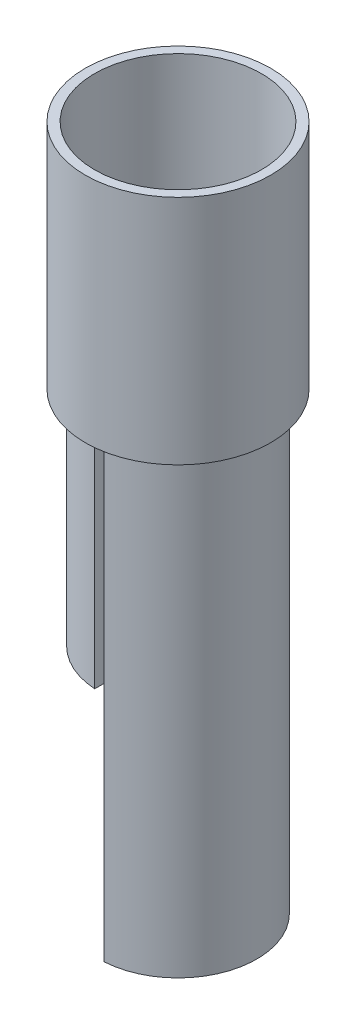
ISO-10303-21;
HEADER;
FILE_DESCRIPTION(('STEP AP214'),'2;1');
FILE_NAME('part.step','',(''),(''),'','','');
FILE_SCHEMA(('AUTOMOTIVE_DESIGN { 1 0 10303 214 1 1 1 1 }'));
ENDSEC;
DATA;
#1=APPLICATION_CONTEXT('core data for automotive mechanical design processes');
#2=APPLICATION_PROTOCOL_DEFINITION('international standard','automotive_design',2000,#1);
#3=PRODUCT_CONTEXT('',#1,'mechanical');
#4=PRODUCT('Part','Part','',(#3));
#5=PRODUCT_RELATED_PRODUCT_CATEGORY('part','',(#4));
#6=PRODUCT_DEFINITION_FORMATION('','',#4);
#7=PRODUCT_DEFINITION_CONTEXT('part definition',#1,'design');
#8=PRODUCT_DEFINITION('design','',#6,#7);
#9=PRODUCT_DEFINITION_SHAPE('','',#8);
#10=(LENGTH_UNIT() NAMED_UNIT(*) SI_UNIT(.MILLI.,.METRE.));
#11=(NAMED_UNIT(*) PLANE_ANGLE_UNIT() SI_UNIT($,.RADIAN.));
#12=(NAMED_UNIT(*) SI_UNIT($,.STERADIAN.) SOLID_ANGLE_UNIT());
#13=UNCERTAINTY_MEASURE_WITH_UNIT(LENGTH_MEASURE(1.E-05),#10,'distance_accuracy_value','');
#14=(GEOMETRIC_REPRESENTATION_CONTEXT(3) GLOBAL_UNCERTAINTY_ASSIGNED_CONTEXT((#13)) GLOBAL_UNIT_ASSIGNED_CONTEXT((#10,
#11,#12)) REPRESENTATION_CONTEXT('',''));
#15=CARTESIAN_POINT('',(0.,0.,0.));
#16=DIRECTION('',(0.,0.,1.));
#17=DIRECTION('',(1.,0.,0.));
#18=AXIS2_PLACEMENT_3D('',#15,#16,#17);
#19=CARTESIAN_POINT('',(0.,-48.,0.));
#20=DIRECTION('',(0.,1.,0.));
#21=DIRECTION('',(0.,0.,1.));
#22=AXIS2_PLACEMENT_3D('',#19,#20,#21);
#23=PLANE('',#22);
#24=DIRECTION('',(0.,0.,1.));
#25=VECTOR('',#24,1.);
#26=CARTESIAN_POINT('',(-0.999999999999993,-48.,0.));
#27=LINE('',#26,#25);
#28=CARTESIAN_POINT('',(-0.999999999999993,-48.,-16.9705627484771));
#29=VERTEX_POINT('',#28);
#30=CARTESIAN_POINT('',(-0.999999999999993,-48.,16.9705627484771));
#31=VERTEX_POINT('',#30);
#32=EDGE_CURVE('E117',#29,#31,#27,.T.);
#33=ORIENTED_EDGE('',*,*,#32,.T.);
#34=CARTESIAN_POINT('',(0.,-48.,0.));
#35=DIRECTION('',(0.,1.,0.));
#36=DIRECTION('',(0.,0.,1.));
#37=AXIS2_PLACEMENT_3D('',#34,#35,#36);
#38=CIRCLE('',#37,17.);
#39=EDGE_CURVE('E119',#29,#31,#38,.T.);
#40=ORIENTED_EDGE('',*,*,#39,.F.);
#41=EDGE_LOOP('',(#33,#40));
#42=FACE_BOUND('',#41,.T.);
#43=DIRECTION('',(0.,0.,1.));
#44=VECTOR('',#43,1.);
#45=CARTESIAN_POINT('',(-2.99999999999999,-48.,0.));
#46=LINE('',#45,#44);
#47=CARTESIAN_POINT('',(-2.99999999999999,-48.,-14.6969384566991));
#48=VERTEX_POINT('',#47);
#49=CARTESIAN_POINT('',(-2.99999999999999,-48.,14.6969384566991));
#50=VERTEX_POINT('',#49);
#51=EDGE_CURVE('E100',#48,#50,#46,.T.);
#52=ORIENTED_EDGE('',*,*,#51,.F.);
#53=CARTESIAN_POINT('',(0.,-48.,0.));
#54=DIRECTION('',(0.,1.,0.));
#55=DIRECTION('',(0.,0.,1.));
#56=AXIS2_PLACEMENT_3D('',#53,#54,#55);
#57=CIRCLE('',#56,15.);
#58=EDGE_CURVE('E115',#48,#50,#57,.T.);
#59=ORIENTED_EDGE('',*,*,#58,.T.);
#60=EDGE_LOOP('',(#52,#59));
#61=FACE_BOUND('',#60,.T.);
#62=ADVANCED_FACE('F60',(#42,#61),#23,.F.);
#63=CARTESIAN_POINT('',(0.,2.,0.));
#64=DIRECTION('',(0.,1.,0.));
#65=DIRECTION('',(0.,0.,1.));
#66=AXIS2_PLACEMENT_3D('',#63,#64,#65);
#67=PLANE('',#66);
#68=DIRECTION('',(0.,0.,1.));
#69=VECTOR('',#68,1.);
#70=CARTESIAN_POINT('',(-0.999999999999993,2.,0.));
#71=LINE('',#70,#69);
#72=CARTESIAN_POINT('',(-0.999999999999993,2.,-16.9705627484771));
#73=VERTEX_POINT('',#72);
#74=CARTESIAN_POINT('',(-0.999999999999993,2.,16.9705627484771));
#75=VERTEX_POINT('',#74);
#76=EDGE_CURVE('E102',#73,#75,#71,.T.);
#77=ORIENTED_EDGE('',*,*,#76,.F.);
#78=CARTESIAN_POINT('',(0.,2.,0.));
#79=DIRECTION('',(0.,1.,0.));
#80=DIRECTION('',(0.,0.,1.));
#81=AXIS2_PLACEMENT_3D('',#78,#79,#80);
#82=CIRCLE('',#81,17.);
#83=EDGE_CURVE('E120',#73,#75,#82,.T.);
#84=ORIENTED_EDGE('',*,*,#83,.T.);
#85=EDGE_LOOP('',(#77,#84));
#86=FACE_BOUND('',#85,.T.);
#87=CARTESIAN_POINT('',(0.,2.,0.));
#88=DIRECTION('',(0.,1.,0.));
#89=DIRECTION('',(0.,0.,1.));
#90=AXIS2_PLACEMENT_3D('',#87,#88,#89);
#91=CIRCLE('',#90,15.);
#92=CARTESIAN_POINT('',(-2.99999999999999,2.,-14.6969384566991));
#93=VERTEX_POINT('',#92);
#94=CARTESIAN_POINT('',(-2.99999999999999,2.,14.6969384566991));
#95=VERTEX_POINT('',#94);
#96=EDGE_CURVE('E106',#93,#95,#91,.T.);
#97=ORIENTED_EDGE('',*,*,#96,.F.);
#98=DIRECTION('',(0.,0.,1.));
#99=VECTOR('',#98,1.);
#100=CARTESIAN_POINT('',(-2.99999999999999,2.,0.));
#101=LINE('',#100,#99);
#102=EDGE_CURVE('E82',#93,#95,#101,.T.);
#103=ORIENTED_EDGE('',*,*,#102,.T.);
#104=EDGE_LOOP('',(#97,#103));
#105=FACE_BOUND('',#104,.T.);
#106=ADVANCED_FACE('F110',(#86,#105),#67,.T.);
#107=CARTESIAN_POINT('',(-0.999999999999993,-48.,0.));
#108=DIRECTION('',(-1.,0.,0.));
#109=DIRECTION('',(0.,0.,1.));
#110=AXIS2_PLACEMENT_3D('',#107,#108,#109);
#111=PLANE('',#110);
#112=ORIENTED_EDGE('',*,*,#76,.T.);
#113=DIRECTION('',(0.,1.,0.));
#114=VECTOR('',#113,1.);
#115=CARTESIAN_POINT('',(-0.999999999999993,-48.,16.9705627484771));
#116=LINE('',#115,#114);
#117=EDGE_CURVE('E12',#31,#75,#116,.T.);
#118=ORIENTED_EDGE('',*,*,#117,.F.);
#119=ORIENTED_EDGE('',*,*,#32,.F.);
#120=DIRECTION('',(0.,1.,0.));
#121=VECTOR('',#120,1.);
#122=CARTESIAN_POINT('',(-0.999999999999993,-48.,-16.9705627484771));
#123=LINE('',#122,#121);
#124=EDGE_CURVE('E64',#29,#73,#123,.T.);
#125=ORIENTED_EDGE('',*,*,#124,.T.);
#126=EDGE_LOOP('',(#112,#118,#119,#125));
#127=FACE_BOUND('',#126,.T.);
#128=ADVANCED_FACE('F62',(#127),#111,.F.);
#129=CARTESIAN_POINT('',(0.,-48.,0.));
#130=DIRECTION('',(0.,1.,0.));
#131=DIRECTION('',(0.,0.,1.));
#132=AXIS2_PLACEMENT_3D('',#129,#130,#131);
#133=CYLINDRICAL_SURFACE('',#132,17.);
#134=ORIENTED_EDGE('',*,*,#83,.F.);
#135=ORIENTED_EDGE('',*,*,#124,.F.);
#136=ORIENTED_EDGE('',*,*,#39,.T.);
#137=ORIENTED_EDGE('',*,*,#117,.T.);
#138=EDGE_LOOP('',(#134,#135,#136,#137));
#139=FACE_BOUND('',#138,.T.);
#140=ADVANCED_FACE('F130',(#139),#133,.T.);
#141=CARTESIAN_POINT('',(-2.99999999999999,-48.,0.));
#142=DIRECTION('',(-1.,0.,0.));
#143=DIRECTION('',(0.,0.,1.));
#144=AXIS2_PLACEMENT_3D('',#141,#142,#143);
#145=PLANE('',#144);
#146=ORIENTED_EDGE('',*,*,#102,.F.);
#147=DIRECTION('',(0.,1.,0.));
#148=VECTOR('',#147,1.);
#149=CARTESIAN_POINT('',(-2.99999999999999,-48.,-14.6969384566991));
#150=LINE('',#149,#148);
#151=EDGE_CURVE('E103',#48,#93,#150,.T.);
#152=ORIENTED_EDGE('',*,*,#151,.F.);
#153=ORIENTED_EDGE('',*,*,#51,.T.);
#154=DIRECTION('',(0.,1.,0.));
#155=VECTOR('',#154,1.);
#156=CARTESIAN_POINT('',(-2.99999999999999,-48.,14.6969384566991));
#157=LINE('',#156,#155);
#158=EDGE_CURVE('E75',#50,#95,#157,.T.);
#159=ORIENTED_EDGE('',*,*,#158,.T.);
#160=EDGE_LOOP('',(#146,#152,#153,#159));
#161=FACE_BOUND('',#160,.T.);
#162=ADVANCED_FACE('F98',(#161),#145,.T.);
#163=CARTESIAN_POINT('',(0.,-48.,0.));
#164=DIRECTION('',(0.,1.,0.));
#165=DIRECTION('',(0.,0.,1.));
#166=AXIS2_PLACEMENT_3D('',#163,#164,#165);
#167=CYLINDRICAL_SURFACE('',#166,15.);
#168=ORIENTED_EDGE('',*,*,#96,.T.);
#169=ORIENTED_EDGE('',*,*,#158,.F.);
#170=ORIENTED_EDGE('',*,*,#58,.F.);
#171=ORIENTED_EDGE('',*,*,#151,.T.);
#172=EDGE_LOOP('',(#168,#169,#170,#171));
#173=FACE_BOUND('',#172,.T.);
#174=ADVANCED_FACE('F107',(#173),#167,.F.);
#175=CLOSED_SHELL('',(#62,#106,#128,#140,#162,#174));
#176=MANIFOLD_SOLID_BREP('B2',#175);
#177=CARTESIAN_POINT('',(0.999999999999998,-48.,0.));
#178=DIRECTION('',(-1.,0.,0.));
#179=DIRECTION('',(0.,0.,1.));
#180=AXIS2_PLACEMENT_3D('',#177,#178,#179);
#181=PLANE('',#180);
#182=DIRECTION('',(0.,0.,1.));
#183=VECTOR('',#182,1.);
#184=CARTESIAN_POINT('',(0.999999999999998,2.,0.));
#185=LINE('',#184,#183);
#186=CARTESIAN_POINT('',(0.999999999999994,2.,-16.9705627484771));
#187=VERTEX_POINT('',#186);
#188=CARTESIAN_POINT('',(1.,2.,16.9705627484771));
#189=VERTEX_POINT('',#188);
#190=EDGE_CURVE('E244',#187,#189,#185,.T.);
#191=ORIENTED_EDGE('',*,*,#190,.F.);
#192=DIRECTION('',(0.,1.,0.));
#193=VECTOR('',#192,1.);
#194=CARTESIAN_POINT('',(0.999999999999994,-48.,-16.9705627484771));
#195=LINE('',#194,#193);
#196=CARTESIAN_POINT('',(0.999999999999994,-98.,-16.9705627484771));
#197=VERTEX_POINT('',#196);
#198=EDGE_CURVE('E58',#197,#187,#195,.T.);
#199=ORIENTED_EDGE('',*,*,#198,.F.);
#200=DIRECTION('',(0.,0.,-1.));
#201=VECTOR('',#200,1.);
#202=CARTESIAN_POINT('',(1.,-98.,16.9705627484771));
#203=LINE('',#202,#201);
#204=CARTESIAN_POINT('',(1.,-98.,16.9705627484771));
#205=VERTEX_POINT('',#204);
#206=EDGE_CURVE('E260',#205,#197,#203,.T.);
#207=ORIENTED_EDGE('',*,*,#206,.F.);
#208=DIRECTION('',(0.,1.,0.));
#209=VECTOR('',#208,1.);
#210=CARTESIAN_POINT('',(1.,-48.,16.9705627484771));
#211=LINE('',#210,#209);
#212=EDGE_CURVE('E198',#205,#189,#211,.T.);
#213=ORIENTED_EDGE('',*,*,#212,.T.);
#214=EDGE_LOOP('',(#191,#199,#207,#213));
#215=FACE_BOUND('',#214,.T.);
#216=ADVANCED_FACE('F195',(#215),#181,.T.);
#217=CARTESIAN_POINT('',(0.,-48.,0.));
#218=DIRECTION('',(0.,1.,0.));
#219=DIRECTION('',(0.,0.,1.));
#220=AXIS2_PLACEMENT_3D('',#217,#218,#219);
#221=CYLINDRICAL_SURFACE('',#220,17.);
#222=CARTESIAN_POINT('',(0.,2.,0.));
#223=DIRECTION('',(0.,1.,0.));
#224=DIRECTION('',(0.,0.,1.));
#225=AXIS2_PLACEMENT_3D('',#222,#223,#224);
#226=CIRCLE('',#225,17.);
#227=EDGE_CURVE('E273',#189,#187,#226,.T.);
#228=ORIENTED_EDGE('',*,*,#227,.F.);
#229=ORIENTED_EDGE('',*,*,#212,.F.);
#230=CARTESIAN_POINT('',(0.,-98.,0.));
#231=DIRECTION('',(0.,-1.,0.));
#232=DIRECTION('',(0.,0.,-1.));
#233=AXIS2_PLACEMENT_3D('',#230,#231,#232);
#234=CIRCLE('',#233,17.);
#235=EDGE_CURVE('E251',#197,#205,#234,.T.);
#236=ORIENTED_EDGE('',*,*,#235,.F.);
#237=ORIENTED_EDGE('',*,*,#198,.T.);
#238=EDGE_LOOP('',(#228,#229,#236,#237));
#239=FACE_BOUND('',#238,.T.);
#240=ADVANCED_FACE('F281',(#239),#221,.T.);
#241=CARTESIAN_POINT('',(0.,2.,0.));
#242=DIRECTION('',(0.,1.,0.));
#243=DIRECTION('',(0.,0.,1.));
#244=AXIS2_PLACEMENT_3D('',#241,#242,#243);
#245=PLANE('',#244);
#246=DIRECTION('',(0.,0.,1.));
#247=VECTOR('',#246,1.);
#248=CARTESIAN_POINT('',(3.,2.,0.));
#249=LINE('',#248,#247);
#250=CARTESIAN_POINT('',(2.99999999999999,2.,-14.6969384566991));
#251=VERTEX_POINT('',#250);
#252=CARTESIAN_POINT('',(3.,2.,14.6969384566991));
#253=VERTEX_POINT('',#252);
#254=EDGE_CURVE('E210',#251,#253,#249,.T.);
#255=ORIENTED_EDGE('',*,*,#254,.F.);
#256=CARTESIAN_POINT('',(0.,2.,0.));
#257=DIRECTION('',(0.,1.,0.));
#258=DIRECTION('',(0.,0.,1.));
#259=AXIS2_PLACEMENT_3D('',#256,#257,#258);
#260=CIRCLE('',#259,15.);
#261=EDGE_CURVE('E242',#253,#251,#260,.T.);
#262=ORIENTED_EDGE('',*,*,#261,.F.);
#263=EDGE_LOOP('',(#255,#262));
#264=FACE_BOUND('',#263,.T.);
#265=ORIENTED_EDGE('',*,*,#190,.T.);
#266=ORIENTED_EDGE('',*,*,#227,.T.);
#267=EDGE_LOOP('',(#265,#266));
#268=FACE_BOUND('',#267,.T.);
#269=ADVANCED_FACE('F280',(#264,#268),#245,.T.);
#270=CARTESIAN_POINT('',(3.,-48.,0.));
#271=DIRECTION('',(-1.,0.,0.));
#272=DIRECTION('',(0.,0.,1.));
#273=AXIS2_PLACEMENT_3D('',#270,#271,#272);
#274=PLANE('',#273);
#275=ORIENTED_EDGE('',*,*,#254,.T.);
#276=DIRECTION('',(0.,1.,0.));
#277=VECTOR('',#276,1.);
#278=CARTESIAN_POINT('',(3.,-48.,14.6969384566991));
#279=LINE('',#278,#277);
#280=CARTESIAN_POINT('',(3.,-98.,14.6969384566991));
#281=VERTEX_POINT('',#280);
#282=EDGE_CURVE('E245',#281,#253,#279,.T.);
#283=ORIENTED_EDGE('',*,*,#282,.F.);
#284=DIRECTION('',(0.,0.,-1.));
#285=VECTOR('',#284,1.);
#286=CARTESIAN_POINT('',(3.,-98.,14.6969384566991));
#287=LINE('',#286,#285);
#288=CARTESIAN_POINT('',(2.99999999999999,-98.,-14.6969384566991));
#289=VERTEX_POINT('',#288);
#290=EDGE_CURVE('E247',#281,#289,#287,.T.);
#291=ORIENTED_EDGE('',*,*,#290,.T.);
#292=DIRECTION('',(0.,1.,0.));
#293=VECTOR('',#292,1.);
#294=CARTESIAN_POINT('',(2.99999999999999,-48.,-14.6969384566991));
#295=LINE('',#294,#293);
#296=EDGE_CURVE('E235',#289,#251,#295,.T.);
#297=ORIENTED_EDGE('',*,*,#296,.T.);
#298=EDGE_LOOP('',(#275,#283,#291,#297));
#299=FACE_BOUND('',#298,.T.);
#300=ADVANCED_FACE('F248',(#299),#274,.F.);
#301=CARTESIAN_POINT('',(0.,-48.,0.));
#302=DIRECTION('',(0.,1.,0.));
#303=DIRECTION('',(0.,0.,1.));
#304=AXIS2_PLACEMENT_3D('',#301,#302,#303);
#305=CYLINDRICAL_SURFACE('',#304,15.);
#306=ORIENTED_EDGE('',*,*,#261,.T.);
#307=ORIENTED_EDGE('',*,*,#296,.F.);
#308=CARTESIAN_POINT('',(0.,-98.,0.));
#309=DIRECTION('',(0.,-1.,0.));
#310=DIRECTION('',(0.,0.,-1.));
#311=AXIS2_PLACEMENT_3D('',#308,#309,#310);
#312=CIRCLE('',#311,15.);
#313=EDGE_CURVE('E239',#289,#281,#312,.T.);
#314=ORIENTED_EDGE('',*,*,#313,.T.);
#315=ORIENTED_EDGE('',*,*,#282,.T.);
#316=EDGE_LOOP('',(#306,#307,#314,#315));
#317=FACE_BOUND('',#316,.T.);
#318=ADVANCED_FACE('F237',(#317),#305,.F.);
#319=CARTESIAN_POINT('',(0.,-98.,0.));
#320=DIRECTION('',(0.,-1.,0.));
#321=DIRECTION('',(0.,0.,-1.));
#322=AXIS2_PLACEMENT_3D('',#319,#320,#321);
#323=PLANE('',#322);
#324=ORIENTED_EDGE('',*,*,#235,.T.);
#325=ORIENTED_EDGE('',*,*,#206,.T.);
#326=EDGE_LOOP('',(#324,#325));
#327=FACE_BOUND('',#326,.T.);
#328=ORIENTED_EDGE('',*,*,#290,.F.);
#329=ORIENTED_EDGE('',*,*,#313,.F.);
#330=EDGE_LOOP('',(#328,#329));
#331=FACE_BOUND('',#330,.T.);
#332=ADVANCED_FACE('F253',(#327,#331),#323,.T.);
#333=CLOSED_SHELL('',(#216,#240,#269,#300,#318,#332));
#334=MANIFOLD_SOLID_BREP('B6',#333);
#335=CARTESIAN_POINT('',(0.,0.,0.));
#336=DIRECTION('',(0.,1.,0.));
#337=DIRECTION('',(0.,0.,1.));
#338=AXIS2_PLACEMENT_3D('',#335,#336,#337);
#339=PLANE('',#338);
#340=CARTESIAN_POINT('',(0.,0.,0.));
#341=DIRECTION('',(0.,1.,0.));
#342=DIRECTION('',(0.,0.,1.));
#343=AXIS2_PLACEMENT_3D('',#340,#341,#342);
#344=CIRCLE('',#343,17.);
#345=CARTESIAN_POINT('',(1.,0.,16.9705627484771));
#346=VERTEX_POINT('',#345);
#347=CARTESIAN_POINT('',(0.999999999999994,0.,-16.9705627484771));
#348=VERTEX_POINT('',#347);
#349=EDGE_CURVE('E391',#346,#348,#344,.T.);
#350=ORIENTED_EDGE('',*,*,#349,.T.);
#351=DIRECTION('',(0.,0.,1.));
#352=VECTOR('',#351,1.);
#353=CARTESIAN_POINT('',(0.999999999999998,0.,0.));
#354=LINE('',#353,#352);
#355=EDGE_CURVE('E389',#348,#346,#354,.T.);
#356=ORIENTED_EDGE('',*,*,#355,.T.);
#357=EDGE_LOOP('',(#350,#356));
#358=FACE_BOUND('',#357,.T.);
#359=CARTESIAN_POINT('',(0.,0.,0.));
#360=DIRECTION('',(0.,1.,0.));
#361=DIRECTION('',(0.,0.,1.));
#362=AXIS2_PLACEMENT_3D('',#359,#360,#361);
#363=CIRCLE('',#362,20.);
#364=CARTESIAN_POINT('',(0.,0.,20.));
#365=VERTEX_POINT('',#364);
#366=EDGE_CURVE('E421',#365,#365,#363,.T.);
#367=ORIENTED_EDGE('',*,*,#366,.F.);
#368=EDGE_LOOP('',(#367));
#369=FACE_BOUND('',#368,.T.);
#370=DIRECTION('',(0.,0.,1.));
#371=VECTOR('',#370,1.);
#372=CARTESIAN_POINT('',(-0.999999999999993,0.,0.));
#373=LINE('',#372,#371);
#374=CARTESIAN_POINT('',(-0.999999999999993,0.,-16.9705627484771));
#375=VERTEX_POINT('',#374);
#376=CARTESIAN_POINT('',(-0.999999999999993,0.,16.9705627484771));
#377=VERTEX_POINT('',#376);
#378=EDGE_CURVE('E193',#375,#377,#373,.T.);
#379=ORIENTED_EDGE('',*,*,#378,.F.);
#380=CARTESIAN_POINT('',(0.,0.,0.));
#381=DIRECTION('',(0.,1.,0.));
#382=DIRECTION('',(0.,0.,1.));
#383=AXIS2_PLACEMENT_3D('',#380,#381,#382);
#384=CIRCLE('',#383,17.);
#385=EDGE_CURVE('E353',#375,#377,#384,.T.);
#386=ORIENTED_EDGE('',*,*,#385,.T.);
#387=EDGE_LOOP('',(#379,#386));
#388=FACE_BOUND('',#387,.T.);
#389=ADVANCED_FACE('F345',(#358,#369,#388),#339,.F.);
#390=CARTESIAN_POINT('',(0.,2.,0.));
#391=DIRECTION('',(0.,1.,0.));
#392=DIRECTION('',(0.,0.,1.));
#393=AXIS2_PLACEMENT_3D('',#390,#391,#392);
#394=PLANE('',#393);
#395=DIRECTION('',(0.,0.,1.));
#396=VECTOR('',#395,1.);
#397=CARTESIAN_POINT('',(0.999999999999998,2.,0.));
#398=LINE('',#397,#396);
#399=CARTESIAN_POINT('',(0.999999999999994,2.,-16.9705627484771));
#400=VERTEX_POINT('',#399);
#401=CARTESIAN_POINT('',(1.,2.,16.9705627484771));
#402=VERTEX_POINT('',#401);
#403=EDGE_CURVE('E386',#400,#402,#398,.T.);
#404=ORIENTED_EDGE('',*,*,#403,.F.);
#405=CARTESIAN_POINT('',(0.,2.,0.));
#406=DIRECTION('',(0.,1.,0.));
#407=DIRECTION('',(0.,0.,1.));
#408=AXIS2_PLACEMENT_3D('',#405,#406,#407);
#409=CIRCLE('',#408,17.);
#410=EDGE_CURVE('E395',#402,#400,#409,.T.);
#411=ORIENTED_EDGE('',*,*,#410,.F.);
#412=EDGE_LOOP('',(#404,#411));
#413=FACE_BOUND('',#412,.T.);
#414=CARTESIAN_POINT('',(0.,2.,0.));
#415=DIRECTION('',(0.,1.,0.));
#416=DIRECTION('',(0.,0.,1.));
#417=AXIS2_PLACEMENT_3D('',#414,#415,#416);
#418=CIRCLE('',#417,18.);
#419=CARTESIAN_POINT('',(0.,2.,18.));
#420=VERTEX_POINT('',#419);
#421=EDGE_CURVE('E415',#420,#420,#418,.T.);
#422=ORIENTED_EDGE('',*,*,#421,.T.);
#423=EDGE_LOOP('',(#422));
#424=FACE_BOUND('',#423,.T.);
#425=CARTESIAN_POINT('',(0.,2.,0.));
#426=DIRECTION('',(0.,1.,0.));
#427=DIRECTION('',(0.,0.,1.));
#428=AXIS2_PLACEMENT_3D('',#425,#426,#427);
#429=CIRCLE('',#428,17.);
#430=CARTESIAN_POINT('',(-0.999999999999993,2.,-16.9705627484771));
#431=VERTEX_POINT('',#430);
#432=CARTESIAN_POINT('',(-0.999999999999993,2.,16.9705627484771));
#433=VERTEX_POINT('',#432);
#434=EDGE_CURVE('E409',#431,#433,#429,.T.);
#435=ORIENTED_EDGE('',*,*,#434,.F.);
#436=DIRECTION('',(0.,0.,1.));
#437=VECTOR('',#436,1.);
#438=CARTESIAN_POINT('',(-0.999999999999993,2.,0.));
#439=LINE('',#438,#437);
#440=EDGE_CURVE('E406',#431,#433,#439,.T.);
#441=ORIENTED_EDGE('',*,*,#440,.T.);
#442=EDGE_LOOP('',(#435,#441));
#443=FACE_BOUND('',#442,.T.);
#444=ADVANCED_FACE('F399',(#413,#424,#443),#394,.T.);
#445=CARTESIAN_POINT('',(0.,50.,0.));
#446=DIRECTION('',(0.,-1.,0.));
#447=DIRECTION('',(0.,0.,-1.));
#448=AXIS2_PLACEMENT_3D('',#445,#446,#447);
#449=CYLINDRICAL_SURFACE('',#448,20.);
#450=CARTESIAN_POINT('',(0.,50.,0.));
#451=DIRECTION('',(0.,1.,0.));
#452=DIRECTION('',(0.,0.,1.));
#453=AXIS2_PLACEMENT_3D('',#450,#451,#452);
#454=CIRCLE('',#453,20.);
#455=CARTESIAN_POINT('',(0.,50.,20.));
#456=VERTEX_POINT('',#455);
#457=EDGE_CURVE('E422',#456,#456,#454,.T.);
#458=ORIENTED_EDGE('',*,*,#457,.F.);
#459=EDGE_LOOP('',(#458));
#460=FACE_BOUND('',#459,.T.);
#461=ORIENTED_EDGE('',*,*,#366,.T.);
#462=EDGE_LOOP('',(#461));
#463=FACE_BOUND('',#462,.T.);
#464=ADVANCED_FACE('F347',(#460,#463),#449,.T.);
#465=CARTESIAN_POINT('',(0.,50.,0.));
#466=DIRECTION('',(0.,1.,0.));
#467=DIRECTION('',(0.,0.,1.));
#468=AXIS2_PLACEMENT_3D('',#465,#466,#467);
#469=PLANE('',#468);
#470=CARTESIAN_POINT('',(0.,50.,0.));
#471=DIRECTION('',(0.,1.,0.));
#472=DIRECTION('',(0.,0.,1.));
#473=AXIS2_PLACEMENT_3D('',#470,#471,#472);
#474=CIRCLE('',#473,18.);
#475=CARTESIAN_POINT('',(0.,50.,18.));
#476=VERTEX_POINT('',#475);
#477=EDGE_CURVE('E418',#476,#476,#474,.T.);
#478=ORIENTED_EDGE('',*,*,#477,.F.);
#479=EDGE_LOOP('',(#478));
#480=FACE_BOUND('',#479,.T.);
#481=ORIENTED_EDGE('',*,*,#457,.T.);
#482=EDGE_LOOP('',(#481));
#483=FACE_BOUND('',#482,.T.);
#484=ADVANCED_FACE('F442',(#480,#483),#469,.T.);
#485=CARTESIAN_POINT('',(0.,50.,0.));
#486=DIRECTION('',(0.,-1.,0.));
#487=DIRECTION('',(0.,0.,-1.));
#488=AXIS2_PLACEMENT_3D('',#485,#486,#487);
#489=CYLINDRICAL_SURFACE('',#488,18.);
#490=ORIENTED_EDGE('',*,*,#477,.T.);
#491=EDGE_LOOP('',(#490));
#492=FACE_BOUND('',#491,.T.);
#493=ORIENTED_EDGE('',*,*,#421,.F.);
#494=EDGE_LOOP('',(#493));
#495=FACE_BOUND('',#494,.T.);
#496=ADVANCED_FACE('F447',(#492,#495),#489,.F.);
#497=CARTESIAN_POINT('',(0.999999999999998,-48.,0.));
#498=DIRECTION('',(-1.,0.,0.));
#499=DIRECTION('',(0.,0.,1.));
#500=AXIS2_PLACEMENT_3D('',#497,#498,#499);
#501=PLANE('',#500);
#502=DIRECTION('',(0.,1.,0.));
#503=VECTOR('',#502,1.);
#504=CARTESIAN_POINT('',(0.999999999999994,-48.,-16.9705627484771));
#505=LINE('',#504,#503);
#506=EDGE_CURVE('E360',#348,#400,#505,.T.);
#507=ORIENTED_EDGE('',*,*,#506,.T.);
#508=ORIENTED_EDGE('',*,*,#403,.T.);
#509=DIRECTION('',(0.,1.,0.));
#510=VECTOR('',#509,1.);
#511=CARTESIAN_POINT('',(1.,-48.,16.9705627484771));
#512=LINE('',#511,#510);
#513=EDGE_CURVE('E392',#346,#402,#512,.T.);
#514=ORIENTED_EDGE('',*,*,#513,.F.);
#515=ORIENTED_EDGE('',*,*,#355,.F.);
#516=EDGE_LOOP('',(#507,#508,#514,#515));
#517=FACE_BOUND('',#516,.T.);
#518=ADVANCED_FACE('F383',(#517),#501,.F.);
#519=CARTESIAN_POINT('',(0.,-48.,0.));
#520=DIRECTION('',(0.,1.,0.));
#521=DIRECTION('',(0.,0.,1.));
#522=AXIS2_PLACEMENT_3D('',#519,#520,#521);
#523=CYLINDRICAL_SURFACE('',#522,17.);
#524=ORIENTED_EDGE('',*,*,#513,.T.);
#525=ORIENTED_EDGE('',*,*,#410,.T.);
#526=ORIENTED_EDGE('',*,*,#506,.F.);
#527=ORIENTED_EDGE('',*,*,#349,.F.);
#528=EDGE_LOOP('',(#524,#525,#526,#527));
#529=FACE_BOUND('',#528,.T.);
#530=ADVANCED_FACE('F396',(#529),#523,.F.);
#531=CARTESIAN_POINT('',(-0.999999999999993,-48.,0.));
#532=DIRECTION('',(-1.,0.,0.));
#533=DIRECTION('',(0.,0.,1.));
#534=AXIS2_PLACEMENT_3D('',#531,#532,#533);
#535=PLANE('',#534);
#536=ORIENTED_EDGE('',*,*,#378,.T.);
#537=DIRECTION('',(0.,1.,0.));
#538=VECTOR('',#537,1.);
#539=CARTESIAN_POINT('',(-0.999999999999993,-48.,16.9705627484771));
#540=LINE('',#539,#538);
#541=EDGE_CURVE('E368',#377,#433,#540,.T.);
#542=ORIENTED_EDGE('',*,*,#541,.T.);
#543=ORIENTED_EDGE('',*,*,#440,.F.);
#544=DIRECTION('',(0.,1.,0.));
#545=VECTOR('',#544,1.);
#546=CARTESIAN_POINT('',(-0.999999999999993,-48.,-16.9705627484771));
#547=LINE('',#546,#545);
#548=EDGE_CURVE('E402',#375,#431,#547,.T.);
#549=ORIENTED_EDGE('',*,*,#548,.F.);
#550=EDGE_LOOP('',(#536,#542,#543,#549));
#551=FACE_BOUND('',#550,.T.);
#552=ADVANCED_FACE('F433',(#551),#535,.T.);
#553=CARTESIAN_POINT('',(0.,-48.,0.));
#554=DIRECTION('',(0.,1.,0.));
#555=DIRECTION('',(0.,0.,1.));
#556=AXIS2_PLACEMENT_3D('',#553,#554,#555);
#557=CYLINDRICAL_SURFACE('',#556,17.);
#558=ORIENTED_EDGE('',*,*,#548,.T.);
#559=ORIENTED_EDGE('',*,*,#434,.T.);
#560=ORIENTED_EDGE('',*,*,#541,.F.);
#561=ORIENTED_EDGE('',*,*,#385,.F.);
#562=EDGE_LOOP('',(#558,#559,#560,#561));
#563=FACE_BOUND('',#562,.T.);
#564=ADVANCED_FACE('F430',(#563),#557,.F.);
#565=CLOSED_SHELL('',(#389,#444,#464,#484,#496,#518,#530,#552,#564));
#566=MANIFOLD_SOLID_BREP('B52',#565);
#567=ADVANCED_BREP_SHAPE_REPRESENTATION('',(#18,#176,#334,#566),#14);
#568=SHAPE_DEFINITION_REPRESENTATION(#9,#567);
ENDSEC;
END-ISO-10303-21;
